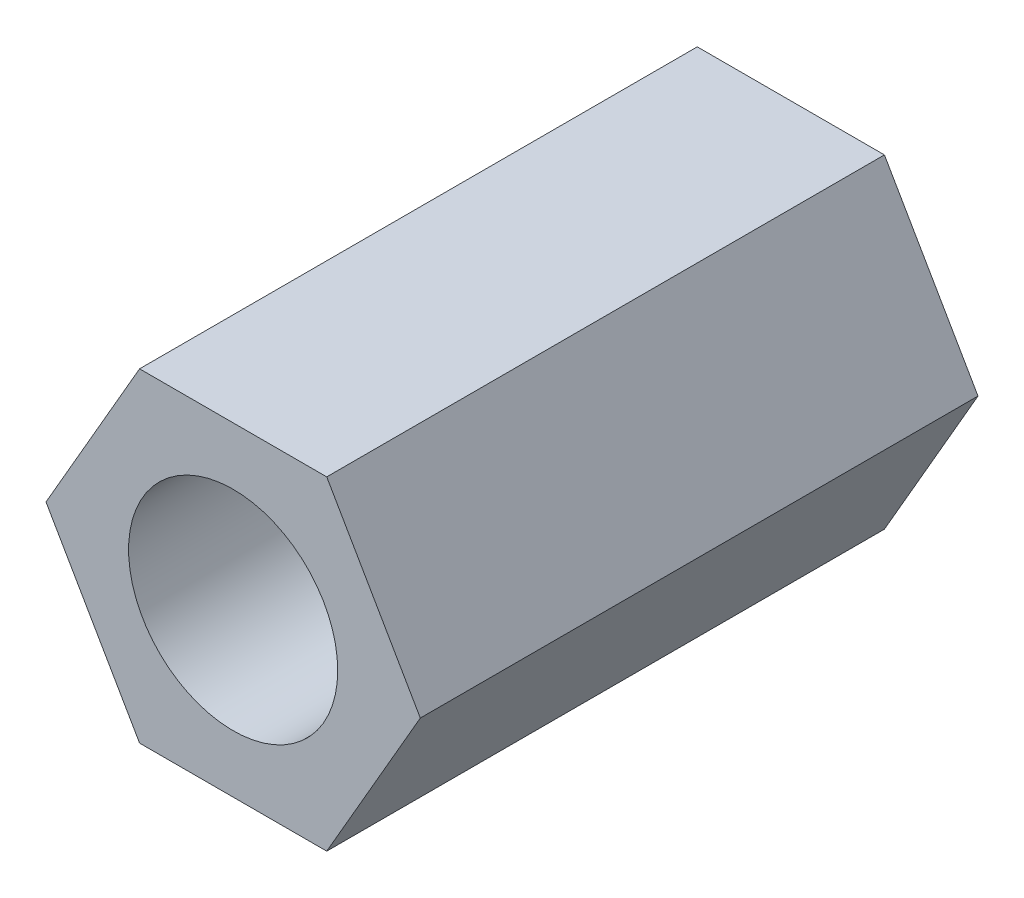
ISO-10303-21;
HEADER;
FILE_DESCRIPTION(('STEP AP214'),'2;1');
FILE_NAME('part.step','',(''),(''),'','','');
FILE_SCHEMA(('AUTOMOTIVE_DESIGN { 1 0 10303 214 1 1 1 1 }'));
ENDSEC;
DATA;
#1=APPLICATION_CONTEXT('core data for automotive mechanical design processes');
#2=APPLICATION_PROTOCOL_DEFINITION('international standard','automotive_design',2000,#1);
#3=PRODUCT_CONTEXT('',#1,'mechanical');
#4=PRODUCT('Part','Part','',(#3));
#5=PRODUCT_RELATED_PRODUCT_CATEGORY('part','',(#4));
#6=PRODUCT_DEFINITION_FORMATION('','',#4);
#7=PRODUCT_DEFINITION_CONTEXT('part definition',#1,'design');
#8=PRODUCT_DEFINITION('design','',#6,#7);
#9=PRODUCT_DEFINITION_SHAPE('','',#8);
#10=(LENGTH_UNIT() NAMED_UNIT(*) SI_UNIT(.MILLI.,.METRE.));
#11=(NAMED_UNIT(*) PLANE_ANGLE_UNIT() SI_UNIT($,.RADIAN.));
#12=(NAMED_UNIT(*) SI_UNIT($,.STERADIAN.) SOLID_ANGLE_UNIT());
#13=UNCERTAINTY_MEASURE_WITH_UNIT(LENGTH_MEASURE(1.E-05),#10,'distance_accuracy_value','');
#14=(GEOMETRIC_REPRESENTATION_CONTEXT(3) GLOBAL_UNCERTAINTY_ASSIGNED_CONTEXT((#13)) GLOBAL_UNIT_ASSIGNED_CONTEXT((#10,
#11,#12)) REPRESENTATION_CONTEXT('',''));
#15=CARTESIAN_POINT('',(0.,0.,0.));
#16=DIRECTION('',(0.,0.,1.));
#17=DIRECTION('',(1.,0.,0.));
#18=AXIS2_PLACEMENT_3D('',#15,#16,#17);
#19=CARTESIAN_POINT('',(0.,0.,8.));
#20=DIRECTION('',(0.,0.,1.));
#21=DIRECTION('',(1.,0.,0.));
#22=AXIS2_PLACEMENT_3D('',#19,#20,#21);
#23=PLANE('',#22);
#24=DIRECTION('',(1.,0.,0.));
#25=VECTOR('',#24,1.);
#26=CARTESIAN_POINT('',(-1.34233937586588,-2.325,8.));
#27=LINE('',#26,#25);
#28=CARTESIAN_POINT('',(-1.34233937586588,-2.325,8.));
#29=VERTEX_POINT('',#28);
#30=CARTESIAN_POINT('',(1.34233937586588,-2.325,8.));
#31=VERTEX_POINT('',#30);
#32=EDGE_CURVE('E156',#29,#31,#27,.T.);
#33=ORIENTED_EDGE('',*,*,#32,.T.);
#34=DIRECTION('',(0.5,0.866025403784439,0.));
#35=VECTOR('',#34,1.);
#36=CARTESIAN_POINT('',(1.34233937586588,-2.325,8.));
#37=LINE('',#36,#35);
#38=CARTESIAN_POINT('',(2.68467875173176,0.,8.));
#39=VERTEX_POINT('',#38);
#40=EDGE_CURVE('E103',#31,#39,#37,.T.);
#41=ORIENTED_EDGE('',*,*,#40,.T.);
#42=DIRECTION('',(-0.5,0.866025403784438,0.));
#43=VECTOR('',#42,1.);
#44=CARTESIAN_POINT('',(2.68467875173176,0.,8.));
#45=LINE('',#44,#43);
#46=CARTESIAN_POINT('',(1.34233937586588,2.325,8.));
#47=VERTEX_POINT('',#46);
#48=EDGE_CURVE('E118',#39,#47,#45,.T.);
#49=ORIENTED_EDGE('',*,*,#48,.T.);
#50=DIRECTION('',(-1.,0.,0.));
#51=VECTOR('',#50,1.);
#52=CARTESIAN_POINT('',(1.34233937586588,2.325,8.));
#53=LINE('',#52,#51);
#54=CARTESIAN_POINT('',(-1.34233937586588,2.325,8.));
#55=VERTEX_POINT('',#54);
#56=EDGE_CURVE('E112',#47,#55,#53,.T.);
#57=ORIENTED_EDGE('',*,*,#56,.T.);
#58=DIRECTION('',(-0.5,-0.866025403784439,0.));
#59=VECTOR('',#58,1.);
#60=CARTESIAN_POINT('',(-1.34233937586588,2.325,8.));
#61=LINE('',#60,#59);
#62=CARTESIAN_POINT('',(-2.68467875173176,0.,8.));
#63=VERTEX_POINT('',#62);
#64=EDGE_CURVE('E116',#55,#63,#61,.T.);
#65=ORIENTED_EDGE('',*,*,#64,.T.);
#66=DIRECTION('',(0.5,-0.866025403784439,0.));
#67=VECTOR('',#66,1.);
#68=CARTESIAN_POINT('',(-2.68467875173176,0.,8.));
#69=LINE('',#68,#67);
#70=EDGE_CURVE('E62',#63,#29,#69,.T.);
#71=ORIENTED_EDGE('',*,*,#70,.T.);
#72=EDGE_LOOP('',(#33,#41,#49,#57,#65,#71));
#73=FACE_BOUND('',#72,.T.);
#74=CARTESIAN_POINT('',(0.,0.,8.));
#75=DIRECTION('',(0.,0.,1.));
#76=DIRECTION('',(1.,0.,0.));
#77=AXIS2_PLACEMENT_3D('',#74,#75,#76);
#78=CIRCLE('',#77,1.5);
#79=CARTESIAN_POINT('',(1.5,0.,8.));
#80=VERTEX_POINT('',#79);
#81=EDGE_CURVE('E146',#80,#80,#78,.T.);
#82=ORIENTED_EDGE('',*,*,#81,.F.);
#83=EDGE_LOOP('',(#82));
#84=FACE_BOUND('',#83,.T.);
#85=ADVANCED_FACE('F41',(#73,#84),#23,.T.);
#86=CARTESIAN_POINT('',(0.,0.,0.));
#87=DIRECTION('',(0.,0.,1.));
#88=DIRECTION('',(1.,0.,0.));
#89=AXIS2_PLACEMENT_3D('',#86,#87,#88);
#90=PLANE('',#89);
#91=DIRECTION('',(1.,0.,0.));
#92=VECTOR('',#91,1.);
#93=CARTESIAN_POINT('',(-1.34233937586588,-2.325,0.));
#94=LINE('',#93,#92);
#95=CARTESIAN_POINT('',(-1.34233937586588,-2.325,0.));
#96=VERTEX_POINT('',#95);
#97=CARTESIAN_POINT('',(1.34233937586588,-2.325,0.));
#98=VERTEX_POINT('',#97);
#99=EDGE_CURVE('E141',#96,#98,#94,.T.);
#100=ORIENTED_EDGE('',*,*,#99,.F.);
#101=DIRECTION('',(0.5,-0.866025403784439,0.));
#102=VECTOR('',#101,1.);
#103=CARTESIAN_POINT('',(-2.68467875173176,0.,0.));
#104=LINE('',#103,#102);
#105=CARTESIAN_POINT('',(-2.68467875173176,0.,0.));
#106=VERTEX_POINT('',#105);
#107=EDGE_CURVE('E95',#106,#96,#104,.T.);
#108=ORIENTED_EDGE('',*,*,#107,.F.);
#109=DIRECTION('',(-0.5,-0.866025403784439,0.));
#110=VECTOR('',#109,1.);
#111=CARTESIAN_POINT('',(-1.34233937586588,2.325,0.));
#112=LINE('',#111,#110);
#113=CARTESIAN_POINT('',(-1.34233937586588,2.325,0.));
#114=VERTEX_POINT('',#113);
#115=EDGE_CURVE('E87',#114,#106,#112,.T.);
#116=ORIENTED_EDGE('',*,*,#115,.F.);
#117=DIRECTION('',(-1.,0.,0.));
#118=VECTOR('',#117,1.);
#119=CARTESIAN_POINT('',(1.34233937586588,2.325,0.));
#120=LINE('',#119,#118);
#121=CARTESIAN_POINT('',(1.34233937586588,2.325,0.));
#122=VERTEX_POINT('',#121);
#123=EDGE_CURVE('E127',#122,#114,#120,.T.);
#124=ORIENTED_EDGE('',*,*,#123,.F.);
#125=DIRECTION('',(-0.5,0.866025403784438,0.));
#126=VECTOR('',#125,1.);
#127=CARTESIAN_POINT('',(2.68467875173176,0.,0.));
#128=LINE('',#127,#126);
#129=CARTESIAN_POINT('',(2.68467875173176,0.,0.));
#130=VERTEX_POINT('',#129);
#131=EDGE_CURVE('E149',#130,#122,#128,.T.);
#132=ORIENTED_EDGE('',*,*,#131,.F.);
#133=DIRECTION('',(0.5,0.866025403784439,0.));
#134=VECTOR('',#133,1.);
#135=CARTESIAN_POINT('',(1.34233937586588,-2.325,0.));
#136=LINE('',#135,#134);
#137=EDGE_CURVE('E145',#98,#130,#136,.T.);
#138=ORIENTED_EDGE('',*,*,#137,.F.);
#139=EDGE_LOOP('',(#100,#108,#116,#124,#132,#138));
#140=FACE_BOUND('',#139,.T.);
#141=CARTESIAN_POINT('',(0.,0.,0.));
#142=DIRECTION('',(0.,0.,1.));
#143=DIRECTION('',(1.,0.,0.));
#144=AXIS2_PLACEMENT_3D('',#141,#142,#143);
#145=CIRCLE('',#144,1.5);
#146=CARTESIAN_POINT('',(1.5,0.,0.));
#147=VERTEX_POINT('',#146);
#148=EDGE_CURVE('E254',#147,#147,#145,.T.);
#149=ORIENTED_EDGE('',*,*,#148,.T.);
#150=EDGE_LOOP('',(#149));
#151=FACE_BOUND('',#150,.T.);
#152=ADVANCED_FACE('F168',(#140,#151),#90,.F.);
#153=CARTESIAN_POINT('',(-1.34233937586588,-2.325,8.));
#154=DIRECTION('',(0.,1.,0.));
#155=DIRECTION('',(-1.,0.,0.));
#156=AXIS2_PLACEMENT_3D('',#153,#154,#155);
#157=PLANE('',#156);
#158=ORIENTED_EDGE('',*,*,#99,.T.);
#159=DIRECTION('',(0.,0.,-1.));
#160=VECTOR('',#159,1.);
#161=CARTESIAN_POINT('',(1.34233937586588,-2.325,8.));
#162=LINE('',#161,#160);
#163=EDGE_CURVE('E11',#31,#98,#162,.T.);
#164=ORIENTED_EDGE('',*,*,#163,.F.);
#165=ORIENTED_EDGE('',*,*,#32,.F.);
#166=DIRECTION('',(0.,0.,-1.));
#167=VECTOR('',#166,1.);
#168=CARTESIAN_POINT('',(-1.34233937586588,-2.325,8.));
#169=LINE('',#168,#167);
#170=EDGE_CURVE('E137',#29,#96,#169,.T.);
#171=ORIENTED_EDGE('',*,*,#170,.T.);
#172=EDGE_LOOP('',(#158,#164,#165,#171));
#173=FACE_BOUND('',#172,.T.);
#174=ADVANCED_FACE('F43',(#173),#157,.F.);
#175=CARTESIAN_POINT('',(1.34233937586588,-2.325,8.));
#176=DIRECTION('',(-0.866025403784439,0.5,0.));
#177=DIRECTION('',(-0.5,-0.866025403784439,0.));
#178=AXIS2_PLACEMENT_3D('',#175,#176,#177);
#179=PLANE('',#178);
#180=ORIENTED_EDGE('',*,*,#137,.T.);
#181=DIRECTION('',(0.,0.,-1.));
#182=VECTOR('',#181,1.);
#183=CARTESIAN_POINT('',(2.68467875173176,0.,8.));
#184=LINE('',#183,#182);
#185=EDGE_CURVE('E51',#39,#130,#184,.T.);
#186=ORIENTED_EDGE('',*,*,#185,.F.);
#187=ORIENTED_EDGE('',*,*,#40,.F.);
#188=ORIENTED_EDGE('',*,*,#163,.T.);
#189=EDGE_LOOP('',(#180,#186,#187,#188));
#190=FACE_BOUND('',#189,.T.);
#191=ADVANCED_FACE('F193',(#190),#179,.F.);
#192=CARTESIAN_POINT('',(2.68467875173176,0.,8.));
#193=DIRECTION('',(-0.866025403784438,-0.5,0.));
#194=DIRECTION('',(0.5,-0.866025403784438,0.));
#195=AXIS2_PLACEMENT_3D('',#192,#193,#194);
#196=PLANE('',#195);
#197=ORIENTED_EDGE('',*,*,#131,.T.);
#198=DIRECTION('',(0.,0.,-1.));
#199=VECTOR('',#198,1.);
#200=CARTESIAN_POINT('',(1.34233937586588,2.325,8.));
#201=LINE('',#200,#199);
#202=EDGE_CURVE('E129',#47,#122,#201,.T.);
#203=ORIENTED_EDGE('',*,*,#202,.F.);
#204=ORIENTED_EDGE('',*,*,#48,.F.);
#205=ORIENTED_EDGE('',*,*,#185,.T.);
#206=EDGE_LOOP('',(#197,#203,#204,#205));
#207=FACE_BOUND('',#206,.T.);
#208=ADVANCED_FACE('F165',(#207),#196,.F.);
#209=CARTESIAN_POINT('',(1.34233937586588,2.325,8.));
#210=DIRECTION('',(0.,-1.,0.));
#211=DIRECTION('',(0.,0.,-1.));
#212=AXIS2_PLACEMENT_3D('',#209,#210,#211);
#213=PLANE('',#212);
#214=ORIENTED_EDGE('',*,*,#123,.T.);
#215=DIRECTION('',(0.,0.,-1.));
#216=VECTOR('',#215,1.);
#217=CARTESIAN_POINT('',(-1.34233937586588,2.325,8.));
#218=LINE('',#217,#216);
#219=EDGE_CURVE('E124',#55,#114,#218,.T.);
#220=ORIENTED_EDGE('',*,*,#219,.F.);
#221=ORIENTED_EDGE('',*,*,#56,.F.);
#222=ORIENTED_EDGE('',*,*,#202,.T.);
#223=EDGE_LOOP('',(#214,#220,#221,#222));
#224=FACE_BOUND('',#223,.T.);
#225=ADVANCED_FACE('F125',(#224),#213,.F.);
#226=CARTESIAN_POINT('',(-1.34233937586588,2.325,8.));
#227=DIRECTION('',(0.866025403784439,-0.5,0.));
#228=DIRECTION('',(0.5,0.866025403784439,0.));
#229=AXIS2_PLACEMENT_3D('',#226,#227,#228);
#230=PLANE('',#229);
#231=ORIENTED_EDGE('',*,*,#115,.T.);
#232=DIRECTION('',(0.,0.,-1.));
#233=VECTOR('',#232,1.);
#234=CARTESIAN_POINT('',(-2.68467875173176,0.,8.));
#235=LINE('',#234,#233);
#236=EDGE_CURVE('E130',#63,#106,#235,.T.);
#237=ORIENTED_EDGE('',*,*,#236,.F.);
#238=ORIENTED_EDGE('',*,*,#64,.F.);
#239=ORIENTED_EDGE('',*,*,#219,.T.);
#240=EDGE_LOOP('',(#231,#237,#238,#239));
#241=FACE_BOUND('',#240,.T.);
#242=ADVANCED_FACE('F132',(#241),#230,.F.);
#243=CARTESIAN_POINT('',(-2.68467875173176,0.,8.));
#244=DIRECTION('',(0.866025403784439,0.5,0.));
#245=DIRECTION('',(-0.5,0.866025403784439,0.));
#246=AXIS2_PLACEMENT_3D('',#243,#244,#245);
#247=PLANE('',#246);
#248=ORIENTED_EDGE('',*,*,#107,.T.);
#249=ORIENTED_EDGE('',*,*,#170,.F.);
#250=ORIENTED_EDGE('',*,*,#70,.F.);
#251=ORIENTED_EDGE('',*,*,#236,.T.);
#252=EDGE_LOOP('',(#248,#249,#250,#251));
#253=FACE_BOUND('',#252,.T.);
#254=ADVANCED_FACE('F173',(#253),#247,.F.);
#255=CARTESIAN_POINT('',(0.,0.,8.));
#256=DIRECTION('',(0.,0.,-1.));
#257=DIRECTION('',(-1.,0.,0.));
#258=AXIS2_PLACEMENT_3D('',#255,#256,#257);
#259=CYLINDRICAL_SURFACE('',#258,1.5);
#260=ORIENTED_EDGE('',*,*,#81,.T.);
#261=EDGE_LOOP('',(#260));
#262=FACE_BOUND('',#261,.T.);
#263=ORIENTED_EDGE('',*,*,#148,.F.);
#264=EDGE_LOOP('',(#263));
#265=FACE_BOUND('',#264,.T.);
#266=ADVANCED_FACE('F175',(#262,#265),#259,.F.);
#267=CLOSED_SHELL('',(#85,#152,#174,#191,#208,#225,#242,#254,#266));
#268=MANIFOLD_SOLID_BREP('B2',#267);
#269=ADVANCED_BREP_SHAPE_REPRESENTATION('',(#18,#268),#14);
#270=SHAPE_DEFINITION_REPRESENTATION(#9,#269);
ENDSEC;
END-ISO-10303-21;
